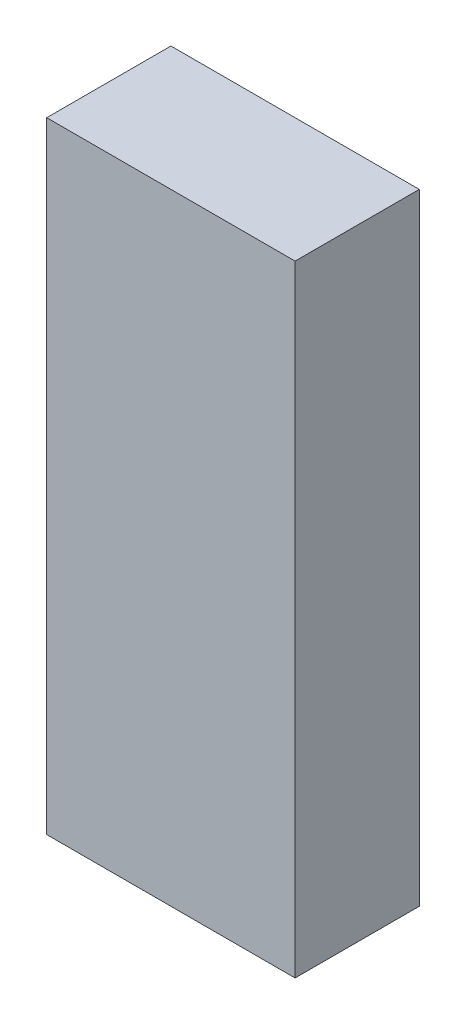
ISO-10303-21;
HEADER;
FILE_DESCRIPTION(('STEP AP214'),'2;1');
FILE_NAME('part.step','',(''),(''),'','','');
FILE_SCHEMA(('AUTOMOTIVE_DESIGN { 1 0 10303 214 1 1 1 1 }'));
ENDSEC;
DATA;
#1=APPLICATION_CONTEXT('core data for automotive mechanical design processes');
#2=APPLICATION_PROTOCOL_DEFINITION('international standard','automotive_design',2000,#1);
#3=PRODUCT_CONTEXT('',#1,'mechanical');
#4=PRODUCT('Part','Part','',(#3));
#5=PRODUCT_RELATED_PRODUCT_CATEGORY('part','',(#4));
#6=PRODUCT_DEFINITION_FORMATION('','',#4);
#7=PRODUCT_DEFINITION_CONTEXT('part definition',#1,'design');
#8=PRODUCT_DEFINITION('design','',#6,#7);
#9=PRODUCT_DEFINITION_SHAPE('','',#8);
#10=(LENGTH_UNIT() NAMED_UNIT(*) SI_UNIT(.MILLI.,.METRE.));
#11=(NAMED_UNIT(*) PLANE_ANGLE_UNIT() SI_UNIT($,.RADIAN.));
#12=(NAMED_UNIT(*) SI_UNIT($,.STERADIAN.) SOLID_ANGLE_UNIT());
#13=UNCERTAINTY_MEASURE_WITH_UNIT(LENGTH_MEASURE(1.E-05),#10,'distance_accuracy_value','');
#14=(GEOMETRIC_REPRESENTATION_CONTEXT(3) GLOBAL_UNCERTAINTY_ASSIGNED_CONTEXT((#13)) GLOBAL_UNIT_ASSIGNED_CONTEXT((#10,
#11,#12)) REPRESENTATION_CONTEXT('',''));
#15=CARTESIAN_POINT('',(0.,0.,0.));
#16=DIRECTION('',(0.,0.,1.));
#17=DIRECTION('',(1.,0.,0.));
#18=AXIS2_PLACEMENT_3D('',#15,#16,#17);
#19=CARTESIAN_POINT('',(0.,500.,0.));
#20=DIRECTION('',(1.,0.,0.));
#21=DIRECTION('',(0.,0.,-1.));
#22=AXIS2_PLACEMENT_3D('',#19,#20,#21);
#23=PLANE('',#22);
#24=DIRECTION('',(0.,0.,1.));
#25=VECTOR('',#24,1.);
#26=CARTESIAN_POINT('',(0.,0.,0.));
#27=LINE('',#26,#25);
#28=CARTESIAN_POINT('',(0.,0.,-100.));
#29=VERTEX_POINT('',#28);
#30=CARTESIAN_POINT('',(0.,0.,0.));
#31=VERTEX_POINT('',#30);
#32=EDGE_CURVE('E96',#29,#31,#27,.T.);
#33=ORIENTED_EDGE('',*,*,#32,.T.);
#34=DIRECTION('',(0.,-1.,0.));
#35=VECTOR('',#34,1.);
#36=CARTESIAN_POINT('',(0.,500.,0.));
#37=LINE('',#36,#35);
#38=CARTESIAN_POINT('',(0.,500.,0.));
#39=VERTEX_POINT('',#38);
#40=EDGE_CURVE('E11',#39,#31,#37,.T.);
#41=ORIENTED_EDGE('',*,*,#40,.F.);
#42=DIRECTION('',(0.,0.,1.));
#43=VECTOR('',#42,1.);
#44=CARTESIAN_POINT('',(0.,500.,0.));
#45=LINE('',#44,#43);
#46=CARTESIAN_POINT('',(0.,500.,-100.));
#47=VERTEX_POINT('',#46);
#48=EDGE_CURVE('E84',#47,#39,#45,.T.);
#49=ORIENTED_EDGE('',*,*,#48,.F.);
#50=DIRECTION('',(0.,-1.,0.));
#51=VECTOR('',#50,1.);
#52=CARTESIAN_POINT('',(0.,500.,-100.));
#53=LINE('',#52,#51);
#54=EDGE_CURVE('E92',#47,#29,#53,.T.);
#55=ORIENTED_EDGE('',*,*,#54,.T.);
#56=EDGE_LOOP('',(#33,#41,#49,#55));
#57=FACE_BOUND('',#56,.T.);
#58=ADVANCED_FACE('F33',(#57),#23,.F.);
#59=CARTESIAN_POINT('',(0.,500.,0.));
#60=DIRECTION('',(0.,0.,-1.));
#61=DIRECTION('',(-1.,0.,0.));
#62=AXIS2_PLACEMENT_3D('',#59,#60,#61);
#63=PLANE('',#62);
#64=DIRECTION('',(1.,0.,0.));
#65=VECTOR('',#64,1.);
#66=CARTESIAN_POINT('',(0.,0.,0.));
#67=LINE('',#66,#65);
#68=CARTESIAN_POINT('',(200.,0.,0.));
#69=VERTEX_POINT('',#68);
#70=EDGE_CURVE('E88',#31,#69,#67,.T.);
#71=ORIENTED_EDGE('',*,*,#70,.T.);
#72=DIRECTION('',(0.,-1.,0.));
#73=VECTOR('',#72,1.);
#74=CARTESIAN_POINT('',(200.,500.,0.));
#75=LINE('',#74,#73);
#76=CARTESIAN_POINT('',(200.,500.,0.));
#77=VERTEX_POINT('',#76);
#78=EDGE_CURVE('E41',#77,#69,#75,.T.);
#79=ORIENTED_EDGE('',*,*,#78,.F.);
#80=DIRECTION('',(1.,0.,0.));
#81=VECTOR('',#80,1.);
#82=CARTESIAN_POINT('',(0.,500.,0.));
#83=LINE('',#82,#81);
#84=EDGE_CURVE('E79',#39,#77,#83,.T.);
#85=ORIENTED_EDGE('',*,*,#84,.F.);
#86=ORIENTED_EDGE('',*,*,#40,.T.);
#87=EDGE_LOOP('',(#71,#79,#85,#86));
#88=FACE_BOUND('',#87,.T.);
#89=ADVANCED_FACE('F87',(#88),#63,.F.);
#90=CARTESIAN_POINT('',(200.,500.,0.));
#91=DIRECTION('',(-1.,0.,0.));
#92=DIRECTION('',(0.,0.,1.));
#93=AXIS2_PLACEMENT_3D('',#90,#91,#92);
#94=PLANE('',#93);
#95=DIRECTION('',(0.,0.,-1.));
#96=VECTOR('',#95,1.);
#97=CARTESIAN_POINT('',(200.,0.,0.));
#98=LINE('',#97,#96);
#99=CARTESIAN_POINT('',(200.,0.,-100.));
#100=VERTEX_POINT('',#99);
#101=EDGE_CURVE('E66',#69,#100,#98,.T.);
#102=ORIENTED_EDGE('',*,*,#101,.T.);
#103=DIRECTION('',(0.,-1.,0.));
#104=VECTOR('',#103,1.);
#105=CARTESIAN_POINT('',(200.,500.,-100.));
#106=LINE('',#105,#104);
#107=CARTESIAN_POINT('',(200.,500.,-100.));
#108=VERTEX_POINT('',#107);
#109=EDGE_CURVE('E89',#108,#100,#106,.T.);
#110=ORIENTED_EDGE('',*,*,#109,.F.);
#111=DIRECTION('',(0.,0.,-1.));
#112=VECTOR('',#111,1.);
#113=CARTESIAN_POINT('',(200.,500.,0.));
#114=LINE('',#113,#112);
#115=EDGE_CURVE('E82',#77,#108,#114,.T.);
#116=ORIENTED_EDGE('',*,*,#115,.F.);
#117=ORIENTED_EDGE('',*,*,#78,.T.);
#118=EDGE_LOOP('',(#102,#110,#116,#117));
#119=FACE_BOUND('',#118,.T.);
#120=ADVANCED_FACE('F90',(#119),#94,.F.);
#121=CARTESIAN_POINT('',(0.,500.,-100.));
#122=DIRECTION('',(0.,0.,1.));
#123=DIRECTION('',(1.,0.,0.));
#124=AXIS2_PLACEMENT_3D('',#121,#122,#123);
#125=PLANE('',#124);
#126=DIRECTION('',(-1.,0.,0.));
#127=VECTOR('',#126,1.);
#128=CARTESIAN_POINT('',(0.,0.,-100.));
#129=LINE('',#128,#127);
#130=EDGE_CURVE('E72',#100,#29,#129,.T.);
#131=ORIENTED_EDGE('',*,*,#130,.T.);
#132=ORIENTED_EDGE('',*,*,#54,.F.);
#133=DIRECTION('',(-1.,0.,0.));
#134=VECTOR('',#133,1.);
#135=CARTESIAN_POINT('',(0.,500.,-100.));
#136=LINE('',#135,#134);
#137=EDGE_CURVE('E49',#108,#47,#136,.T.);
#138=ORIENTED_EDGE('',*,*,#137,.F.);
#139=ORIENTED_EDGE('',*,*,#109,.T.);
#140=EDGE_LOOP('',(#131,#132,#138,#139));
#141=FACE_BOUND('',#140,.T.);
#142=ADVANCED_FACE('F103',(#141),#125,.F.);
#143=CARTESIAN_POINT('',(0.,500.,0.));
#144=DIRECTION('',(0.,-1.,0.));
#145=DIRECTION('',(0.,0.,-1.));
#146=AXIS2_PLACEMENT_3D('',#143,#144,#145);
#147=PLANE('',#146);
#148=ORIENTED_EDGE('',*,*,#48,.T.);
#149=ORIENTED_EDGE('',*,*,#84,.T.);
#150=ORIENTED_EDGE('',*,*,#115,.T.);
#151=ORIENTED_EDGE('',*,*,#137,.T.);
#152=EDGE_LOOP('',(#148,#149,#150,#151));
#153=FACE_BOUND('',#152,.T.);
#154=ADVANCED_FACE('F80',(#153),#147,.F.);
#155=CARTESIAN_POINT('',(0.,0.,0.));
#156=DIRECTION('',(0.,-1.,0.));
#157=DIRECTION('',(0.,0.,-1.));
#158=AXIS2_PLACEMENT_3D('',#155,#156,#157);
#159=PLANE('',#158);
#160=ORIENTED_EDGE('',*,*,#32,.F.);
#161=ORIENTED_EDGE('',*,*,#130,.F.);
#162=ORIENTED_EDGE('',*,*,#101,.F.);
#163=ORIENTED_EDGE('',*,*,#70,.F.);
#164=EDGE_LOOP('',(#160,#161,#162,#163));
#165=FACE_BOUND('',#164,.T.);
#166=ADVANCED_FACE('F106',(#165),#159,.T.);
#167=CLOSED_SHELL('',(#58,#89,#120,#142,#154,#166));
#168=MANIFOLD_SOLID_BREP('B2',#167);
#169=ADVANCED_BREP_SHAPE_REPRESENTATION('',(#18,#168),#14);
#170=SHAPE_DEFINITION_REPRESENTATION(#9,#169);
ENDSEC;
END-ISO-10303-21;
